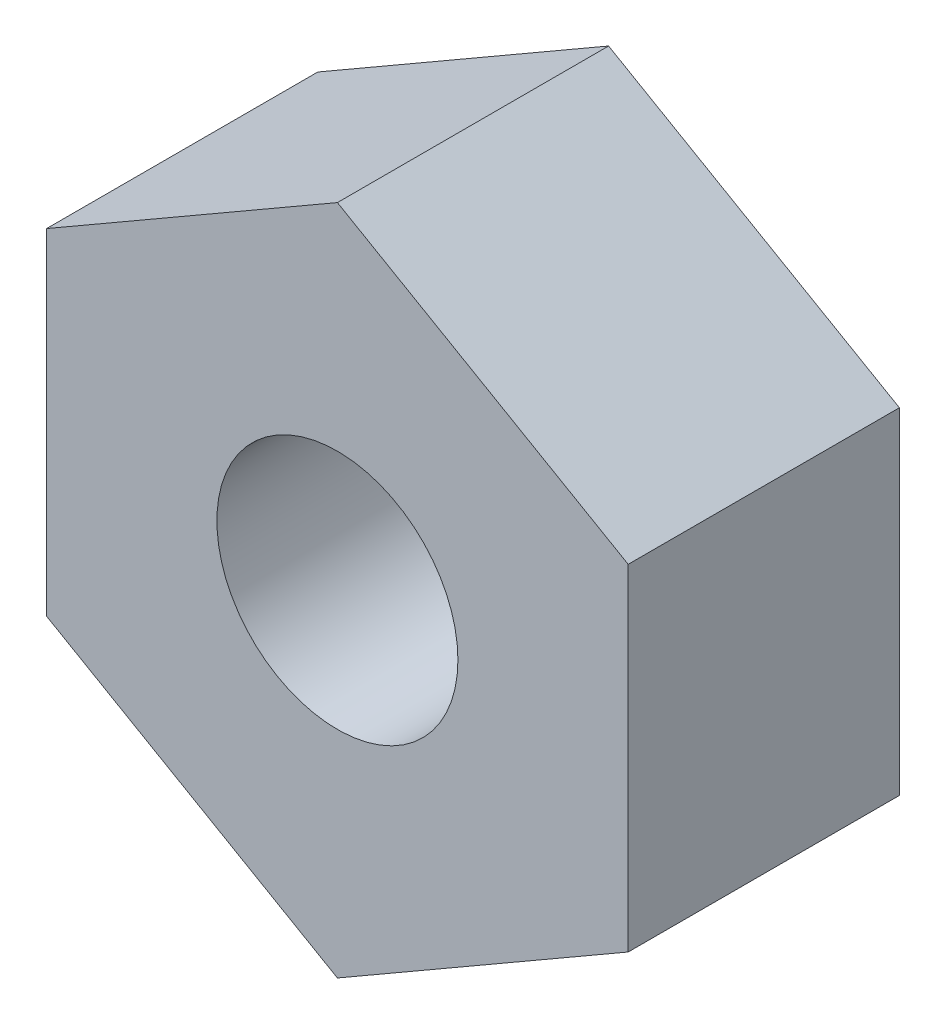
ISO-10303-21;
HEADER;
FILE_DESCRIPTION(('STEP AP214'),'2;1');
FILE_NAME('part.step','',(''),(''),'','','');
FILE_SCHEMA(('AUTOMOTIVE_DESIGN { 1 0 10303 214 1 1 1 1 }'));
ENDSEC;
DATA;
#1=APPLICATION_CONTEXT('core data for automotive mechanical design processes');
#2=APPLICATION_PROTOCOL_DEFINITION('international standard','automotive_design',2000,#1);
#3=PRODUCT_CONTEXT('',#1,'mechanical');
#4=PRODUCT('Part','Part','',(#3));
#5=PRODUCT_RELATED_PRODUCT_CATEGORY('part','',(#4));
#6=PRODUCT_DEFINITION_FORMATION('','',#4);
#7=PRODUCT_DEFINITION_CONTEXT('part definition',#1,'design');
#8=PRODUCT_DEFINITION('design','',#6,#7);
#9=PRODUCT_DEFINITION_SHAPE('','',#8);
#10=(LENGTH_UNIT() NAMED_UNIT(*) SI_UNIT(.MILLI.,.METRE.));
#11=(NAMED_UNIT(*) PLANE_ANGLE_UNIT() SI_UNIT($,.RADIAN.));
#12=(NAMED_UNIT(*) SI_UNIT($,.STERADIAN.) SOLID_ANGLE_UNIT());
#13=UNCERTAINTY_MEASURE_WITH_UNIT(LENGTH_MEASURE(1.E-05),#10,'distance_accuracy_value','');
#14=(GEOMETRIC_REPRESENTATION_CONTEXT(3) GLOBAL_UNCERTAINTY_ASSIGNED_CONTEXT((#13)) GLOBAL_UNIT_ASSIGNED_CONTEXT((#10,
#11,#12)) REPRESENTATION_CONTEXT('',''));
#15=CARTESIAN_POINT('',(0.,0.,0.));
#16=DIRECTION('',(0.,0.,1.));
#17=DIRECTION('',(1.,0.,0.));
#18=AXIS2_PLACEMENT_3D('',#15,#16,#17);
#19=CARTESIAN_POINT('',(0.,0.,4.5));
#20=DIRECTION('',(0.,0.,1.));
#21=DIRECTION('',(1.,0.,0.));
#22=AXIS2_PLACEMENT_3D('',#19,#20,#21);
#23=PLANE('',#22);
#24=DIRECTION('',(-0.866025403784439,0.5,0.));
#25=VECTOR('',#24,1.);
#26=CARTESIAN_POINT('',(9.65,5.57143009767989,4.5));
#27=LINE('',#26,#25);
#28=CARTESIAN_POINT('',(9.65,5.57143009767989,4.5));
#29=VERTEX_POINT('',#28);
#30=CARTESIAN_POINT('',(0.,11.1428601953598,4.5));
#31=VERTEX_POINT('',#30);
#32=EDGE_CURVE('E129',#29,#31,#27,.T.);
#33=ORIENTED_EDGE('',*,*,#32,.T.);
#34=DIRECTION('',(-0.866025403784439,-0.5,0.));
#35=VECTOR('',#34,1.);
#36=CARTESIAN_POINT('',(0.,11.1428601953598,4.5));
#37=LINE('',#36,#35);
#38=CARTESIAN_POINT('',(-9.65,5.57143009767988,4.5));
#39=VERTEX_POINT('',#38);
#40=EDGE_CURVE('E87',#31,#39,#37,.T.);
#41=ORIENTED_EDGE('',*,*,#40,.T.);
#42=DIRECTION('',(0.,-1.,0.));
#43=VECTOR('',#42,1.);
#44=CARTESIAN_POINT('',(-9.65,5.57143009767988,4.5));
#45=LINE('',#44,#43);
#46=CARTESIAN_POINT('',(-9.65,-5.57143009767989,4.5));
#47=VERTEX_POINT('',#46);
#48=EDGE_CURVE('E100',#39,#47,#45,.T.);
#49=ORIENTED_EDGE('',*,*,#48,.T.);
#50=DIRECTION('',(0.866025403784439,-0.5,0.));
#51=VECTOR('',#50,1.);
#52=CARTESIAN_POINT('',(-9.65,-5.57143009767989,4.5));
#53=LINE('',#52,#51);
#54=CARTESIAN_POINT('',(0.,-11.1428601953598,4.5));
#55=VERTEX_POINT('',#54);
#56=EDGE_CURVE('E94',#47,#55,#53,.T.);
#57=ORIENTED_EDGE('',*,*,#56,.T.);
#58=DIRECTION('',(0.866025403784439,0.5,0.));
#59=VECTOR('',#58,1.);
#60=CARTESIAN_POINT('',(0.,-11.1428601953598,4.5));
#61=LINE('',#60,#59);
#62=CARTESIAN_POINT('',(9.65,-5.57143009767988,4.5));
#63=VERTEX_POINT('',#62);
#64=EDGE_CURVE('E98',#55,#63,#61,.T.);
#65=ORIENTED_EDGE('',*,*,#64,.T.);
#66=DIRECTION('',(0.,1.,0.));
#67=VECTOR('',#66,1.);
#68=CARTESIAN_POINT('',(9.65,-5.57143009767988,4.5));
#69=LINE('',#68,#67);
#70=EDGE_CURVE('E50',#63,#29,#69,.T.);
#71=ORIENTED_EDGE('',*,*,#70,.T.);
#72=EDGE_LOOP('',(#33,#41,#49,#57,#65,#71));
#73=FACE_BOUND('',#72,.T.);
#74=CARTESIAN_POINT('',(0.,0.,4.5));
#75=DIRECTION('',(0.,0.,1.));
#76=DIRECTION('',(1.,0.,0.));
#77=AXIS2_PLACEMENT_3D('',#74,#75,#76);
#78=CIRCLE('',#77,4.);
#79=CARTESIAN_POINT('',(4.,0.,4.5));
#80=VERTEX_POINT('',#79);
#81=EDGE_CURVE('E122',#80,#80,#78,.T.);
#82=ORIENTED_EDGE('',*,*,#81,.F.);
#83=EDGE_LOOP('',(#82));
#84=FACE_BOUND('',#83,.T.);
#85=ADVANCED_FACE('F33',(#73,#84),#23,.T.);
#86=CARTESIAN_POINT('',(0.,0.,-4.5));
#87=DIRECTION('',(0.,0.,1.));
#88=DIRECTION('',(1.,0.,0.));
#89=AXIS2_PLACEMENT_3D('',#86,#87,#88);
#90=PLANE('',#89);
#91=DIRECTION('',(-0.866025403784439,0.5,0.));
#92=VECTOR('',#91,1.);
#93=CARTESIAN_POINT('',(9.65,5.57143009767989,-4.5));
#94=LINE('',#93,#92);
#95=CARTESIAN_POINT('',(9.65,5.57143009767989,-4.5));
#96=VERTEX_POINT('',#95);
#97=CARTESIAN_POINT('',(0.,11.1428601953598,-4.5));
#98=VERTEX_POINT('',#97);
#99=EDGE_CURVE('E118',#96,#98,#94,.T.);
#100=ORIENTED_EDGE('',*,*,#99,.F.);
#101=DIRECTION('',(0.,1.,0.));
#102=VECTOR('',#101,1.);
#103=CARTESIAN_POINT('',(9.65,-5.57143009767988,-4.5));
#104=LINE('',#103,#102);
#105=CARTESIAN_POINT('',(9.65,-5.57143009767988,-4.5));
#106=VERTEX_POINT('',#105);
#107=EDGE_CURVE('E79',#106,#96,#104,.T.);
#108=ORIENTED_EDGE('',*,*,#107,.F.);
#109=DIRECTION('',(0.866025403784439,0.5,0.));
#110=VECTOR('',#109,1.);
#111=CARTESIAN_POINT('',(0.,-11.1428601953598,-4.5));
#112=LINE('',#111,#110);
#113=CARTESIAN_POINT('',(0.,-11.1428601953598,-4.5));
#114=VERTEX_POINT('',#113);
#115=EDGE_CURVE('E73',#114,#106,#112,.T.);
#116=ORIENTED_EDGE('',*,*,#115,.F.);
#117=DIRECTION('',(0.866025403784439,-0.5,0.));
#118=VECTOR('',#117,1.);
#119=CARTESIAN_POINT('',(-9.65,-5.57143009767989,-4.5));
#120=LINE('',#119,#118);
#121=CARTESIAN_POINT('',(-9.65,-5.57143009767989,-4.5));
#122=VERTEX_POINT('',#121);
#123=EDGE_CURVE('E108',#122,#114,#120,.T.);
#124=ORIENTED_EDGE('',*,*,#123,.F.);
#125=DIRECTION('',(0.,-1.,0.));
#126=VECTOR('',#125,1.);
#127=CARTESIAN_POINT('',(-9.65,5.57143009767988,-4.5));
#128=LINE('',#127,#126);
#129=CARTESIAN_POINT('',(-9.65,5.57143009767988,-4.5));
#130=VERTEX_POINT('',#129);
#131=EDGE_CURVE('E124',#130,#122,#128,.T.);
#132=ORIENTED_EDGE('',*,*,#131,.F.);
#133=DIRECTION('',(-0.866025403784439,-0.5,0.));
#134=VECTOR('',#133,1.);
#135=CARTESIAN_POINT('',(0.,11.1428601953598,-4.5));
#136=LINE('',#135,#134);
#137=EDGE_CURVE('E121',#98,#130,#136,.T.);
#138=ORIENTED_EDGE('',*,*,#137,.F.);
#139=EDGE_LOOP('',(#100,#108,#116,#124,#132,#138));
#140=FACE_BOUND('',#139,.T.);
#141=CARTESIAN_POINT('',(0.,0.,-4.5));
#142=DIRECTION('',(0.,0.,1.));
#143=DIRECTION('',(1.,0.,0.));
#144=AXIS2_PLACEMENT_3D('',#141,#142,#143);
#145=CIRCLE('',#144,4.);
#146=CARTESIAN_POINT('',(4.,0.,-4.5));
#147=VERTEX_POINT('',#146);
#148=EDGE_CURVE('E222',#147,#147,#145,.T.);
#149=ORIENTED_EDGE('',*,*,#148,.T.);
#150=EDGE_LOOP('',(#149));
#151=FACE_BOUND('',#150,.T.);
#152=ADVANCED_FACE('F138',(#140,#151),#90,.F.);
#153=CARTESIAN_POINT('',(9.65,5.57143009767989,4.5));
#154=DIRECTION('',(-0.5,-0.866025403784439,0.));
#155=DIRECTION('',(0.866025403784439,-0.5,0.));
#156=AXIS2_PLACEMENT_3D('',#153,#154,#155);
#157=PLANE('',#156);
#158=ORIENTED_EDGE('',*,*,#99,.T.);
#159=DIRECTION('',(0.,0.,-1.));
#160=VECTOR('',#159,1.);
#161=CARTESIAN_POINT('',(0.,11.1428601953598,4.5));
#162=LINE('',#161,#160);
#163=EDGE_CURVE('E11',#31,#98,#162,.T.);
#164=ORIENTED_EDGE('',*,*,#163,.F.);
#165=ORIENTED_EDGE('',*,*,#32,.F.);
#166=DIRECTION('',(0.,0.,-1.));
#167=VECTOR('',#166,1.);
#168=CARTESIAN_POINT('',(9.65,5.57143009767989,4.5));
#169=LINE('',#168,#167);
#170=EDGE_CURVE('E114',#29,#96,#169,.T.);
#171=ORIENTED_EDGE('',*,*,#170,.T.);
#172=EDGE_LOOP('',(#158,#164,#165,#171));
#173=FACE_BOUND('',#172,.T.);
#174=ADVANCED_FACE('F35',(#173),#157,.F.);
#175=CARTESIAN_POINT('',(0.,11.1428601953598,4.5));
#176=DIRECTION('',(0.5,-0.866025403784439,0.));
#177=DIRECTION('',(0.866025403784439,0.5,0.));
#178=AXIS2_PLACEMENT_3D('',#175,#176,#177);
#179=PLANE('',#178);
#180=ORIENTED_EDGE('',*,*,#137,.T.);
#181=DIRECTION('',(0.,0.,-1.));
#182=VECTOR('',#181,1.);
#183=CARTESIAN_POINT('',(-9.65,5.57143009767988,4.5));
#184=LINE('',#183,#182);
#185=EDGE_CURVE('E42',#39,#130,#184,.T.);
#186=ORIENTED_EDGE('',*,*,#185,.F.);
#187=ORIENTED_EDGE('',*,*,#40,.F.);
#188=ORIENTED_EDGE('',*,*,#163,.T.);
#189=EDGE_LOOP('',(#180,#186,#187,#188));
#190=FACE_BOUND('',#189,.T.);
#191=ADVANCED_FACE('F163',(#190),#179,.F.);
#192=CARTESIAN_POINT('',(-9.65,5.57143009767988,4.5));
#193=DIRECTION('',(1.,0.,0.));
#194=DIRECTION('',(0.,1.,0.));
#195=AXIS2_PLACEMENT_3D('',#192,#193,#194);
#196=PLANE('',#195);
#197=ORIENTED_EDGE('',*,*,#131,.T.);
#198=DIRECTION('',(0.,0.,-1.));
#199=VECTOR('',#198,1.);
#200=CARTESIAN_POINT('',(-9.65,-5.57143009767989,4.5));
#201=LINE('',#200,#199);
#202=EDGE_CURVE('E109',#47,#122,#201,.T.);
#203=ORIENTED_EDGE('',*,*,#202,.F.);
#204=ORIENTED_EDGE('',*,*,#48,.F.);
#205=ORIENTED_EDGE('',*,*,#185,.T.);
#206=EDGE_LOOP('',(#197,#203,#204,#205));
#207=FACE_BOUND('',#206,.T.);
#208=ADVANCED_FACE('F135',(#207),#196,.F.);
#209=CARTESIAN_POINT('',(-9.65,-5.57143009767989,4.5));
#210=DIRECTION('',(0.5,0.866025403784439,0.));
#211=DIRECTION('',(-0.866025403784439,0.5,0.));
#212=AXIS2_PLACEMENT_3D('',#209,#210,#211);
#213=PLANE('',#212);
#214=ORIENTED_EDGE('',*,*,#123,.T.);
#215=DIRECTION('',(0.,0.,-1.));
#216=VECTOR('',#215,1.);
#217=CARTESIAN_POINT('',(0.,-11.1428601953598,4.5));
#218=LINE('',#217,#216);
#219=EDGE_CURVE('E105',#55,#114,#218,.T.);
#220=ORIENTED_EDGE('',*,*,#219,.F.);
#221=ORIENTED_EDGE('',*,*,#56,.F.);
#222=ORIENTED_EDGE('',*,*,#202,.T.);
#223=EDGE_LOOP('',(#214,#220,#221,#222));
#224=FACE_BOUND('',#223,.T.);
#225=ADVANCED_FACE('F106',(#224),#213,.F.);
#226=CARTESIAN_POINT('',(0.,-11.1428601953598,4.5));
#227=DIRECTION('',(-0.5,0.866025403784439,0.));
#228=DIRECTION('',(-0.866025403784439,-0.5,0.));
#229=AXIS2_PLACEMENT_3D('',#226,#227,#228);
#230=PLANE('',#229);
#231=ORIENTED_EDGE('',*,*,#115,.T.);
#232=DIRECTION('',(0.,0.,-1.));
#233=VECTOR('',#232,1.);
#234=CARTESIAN_POINT('',(9.65,-5.57143009767988,4.5));
#235=LINE('',#234,#233);
#236=EDGE_CURVE('E110',#63,#106,#235,.T.);
#237=ORIENTED_EDGE('',*,*,#236,.F.);
#238=ORIENTED_EDGE('',*,*,#64,.F.);
#239=ORIENTED_EDGE('',*,*,#219,.T.);
#240=EDGE_LOOP('',(#231,#237,#238,#239));
#241=FACE_BOUND('',#240,.T.);
#242=ADVANCED_FACE('F112',(#241),#230,.F.);
#243=CARTESIAN_POINT('',(9.65,-5.57143009767988,4.5));
#244=DIRECTION('',(-1.,0.,0.));
#245=DIRECTION('',(0.,0.,1.));
#246=AXIS2_PLACEMENT_3D('',#243,#244,#245);
#247=PLANE('',#246);
#248=ORIENTED_EDGE('',*,*,#107,.T.);
#249=ORIENTED_EDGE('',*,*,#170,.F.);
#250=ORIENTED_EDGE('',*,*,#70,.F.);
#251=ORIENTED_EDGE('',*,*,#236,.T.);
#252=EDGE_LOOP('',(#248,#249,#250,#251));
#253=FACE_BOUND('',#252,.T.);
#254=ADVANCED_FACE('F143',(#253),#247,.F.);
#255=CARTESIAN_POINT('',(0.,0.,4.5));
#256=DIRECTION('',(0.,0.,-1.));
#257=DIRECTION('',(-1.,0.,0.));
#258=AXIS2_PLACEMENT_3D('',#255,#256,#257);
#259=CYLINDRICAL_SURFACE('',#258,4.);
#260=ORIENTED_EDGE('',*,*,#81,.T.);
#261=EDGE_LOOP('',(#260));
#262=FACE_BOUND('',#261,.T.);
#263=ORIENTED_EDGE('',*,*,#148,.F.);
#264=EDGE_LOOP('',(#263));
#265=FACE_BOUND('',#264,.T.);
#266=ADVANCED_FACE('F145',(#262,#265),#259,.F.);
#267=CLOSED_SHELL('',(#85,#152,#174,#191,#208,#225,#242,#254,#266));
#268=MANIFOLD_SOLID_BREP('B2',#267);
#269=ADVANCED_BREP_SHAPE_REPRESENTATION('',(#18,#268),#14);
#270=SHAPE_DEFINITION_REPRESENTATION(#9,#269);
ENDSEC;
END-ISO-10303-21;
